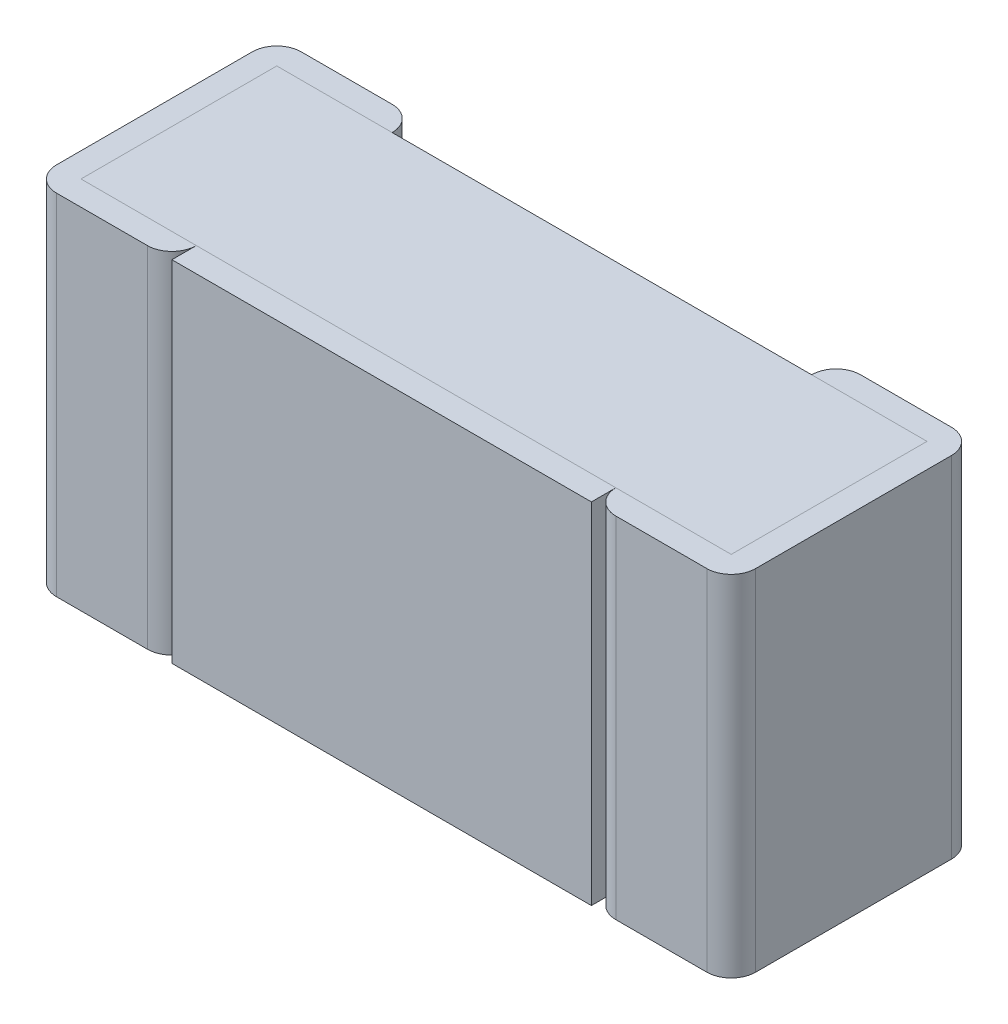
ISO-10303-21;
HEADER;
FILE_DESCRIPTION(('STEP AP214'),'2;1');
FILE_NAME('part.step','',(''),(''),'','','');
FILE_SCHEMA(('AUTOMOTIVE_DESIGN { 1 0 10303 214 1 1 1 1 }'));
ENDSEC;
DATA;
#1=APPLICATION_CONTEXT('core data for automotive mechanical design processes');
#2=APPLICATION_PROTOCOL_DEFINITION('international standard','automotive_design',2000,#1);
#3=PRODUCT_CONTEXT('',#1,'mechanical');
#4=PRODUCT('Part','Part','',(#3));
#5=PRODUCT_RELATED_PRODUCT_CATEGORY('part','',(#4));
#6=PRODUCT_DEFINITION_FORMATION('','',#4);
#7=PRODUCT_DEFINITION_CONTEXT('part definition',#1,'design');
#8=PRODUCT_DEFINITION('design','',#6,#7);
#9=PRODUCT_DEFINITION_SHAPE('','',#8);
#10=(LENGTH_UNIT() NAMED_UNIT(*) SI_UNIT(.MILLI.,.METRE.));
#11=(NAMED_UNIT(*) PLANE_ANGLE_UNIT() SI_UNIT($,.RADIAN.));
#12=(NAMED_UNIT(*) SI_UNIT($,.STERADIAN.) SOLID_ANGLE_UNIT());
#13=UNCERTAINTY_MEASURE_WITH_UNIT(LENGTH_MEASURE(1.E-05),#10,'distance_accuracy_value','');
#14=(GEOMETRIC_REPRESENTATION_CONTEXT(3) GLOBAL_UNCERTAINTY_ASSIGNED_CONTEXT((#13)) GLOBAL_UNIT_ASSIGNED_CONTEXT((#10,
#11,#12)) REPRESENTATION_CONTEXT('',''));
#15=CARTESIAN_POINT('',(0.,0.,0.));
#16=DIRECTION('',(0.,0.,1.));
#17=DIRECTION('',(1.,0.,0.));
#18=AXIS2_PLACEMENT_3D('',#15,#16,#17);
#19=CARTESIAN_POINT('',(-0.3,-0.25,0.35));
#20=DIRECTION('',(0.,0.,1.));
#21=DIRECTION('',(1.,0.,0.));
#22=AXIS2_PLACEMENT_3D('',#19,#20,#21);
#23=PLANE('',#22);
#24=DIRECTION('',(0.,1.,0.));
#25=VECTOR('',#24,1.);
#26=CARTESIAN_POINT('',(-0.3,-0.25,0.35));
#27=LINE('',#26,#25);
#28=CARTESIAN_POINT('',(-0.3,-0.25,0.35));
#29=VERTEX_POINT('',#28);
#30=CARTESIAN_POINT('',(-0.3,0.25,0.35));
#31=VERTEX_POINT('',#30);
#32=EDGE_CURVE('E232',#29,#31,#27,.T.);
#33=ORIENTED_EDGE('',*,*,#32,.F.);
#34=DIRECTION('',(1.,0.,0.));
#35=VECTOR('',#34,1.);
#36=CARTESIAN_POINT('',(-0.3,-0.25,0.35));
#37=LINE('',#36,#35);
#38=CARTESIAN_POINT('',(0.3,-0.25,0.35));
#39=VERTEX_POINT('',#38);
#40=EDGE_CURVE('E344',#29,#39,#37,.T.);
#41=ORIENTED_EDGE('',*,*,#40,.T.);
#42=DIRECTION('',(0.,1.,0.));
#43=VECTOR('',#42,1.);
#44=CARTESIAN_POINT('',(0.3,-0.25,0.35));
#45=LINE('',#44,#43);
#46=CARTESIAN_POINT('',(0.3,0.25,0.35));
#47=VERTEX_POINT('',#46);
#48=EDGE_CURVE('E11',#39,#47,#45,.T.);
#49=ORIENTED_EDGE('',*,*,#48,.T.);
#50=DIRECTION('',(1.,0.,0.));
#51=VECTOR('',#50,1.);
#52=CARTESIAN_POINT('',(-0.3,0.25,0.35));
#53=LINE('',#52,#51);
#54=EDGE_CURVE('E279',#31,#47,#53,.T.);
#55=ORIENTED_EDGE('',*,*,#54,.F.);
#56=EDGE_LOOP('',(#33,#41,#49,#55));
#57=FACE_BOUND('',#56,.T.);
#58=ADVANCED_FACE('F17',(#57),#23,.T.);
#59=CARTESIAN_POINT('',(0.3,-0.25,0.315));
#60=DIRECTION('',(1.,0.,0.));
#61=DIRECTION('',(0.,1.,0.));
#62=AXIS2_PLACEMENT_3D('',#59,#60,#61);
#63=PLANE('',#62);
#64=DIRECTION('',(0.,0.,1.));
#65=VECTOR('',#64,1.);
#66=CARTESIAN_POINT('',(0.3,-0.25,0.315));
#67=LINE('',#66,#65);
#68=CARTESIAN_POINT('',(0.3,-0.25,0.315));
#69=VERTEX_POINT('',#68);
#70=EDGE_CURVE('E340',#69,#39,#67,.T.);
#71=ORIENTED_EDGE('',*,*,#70,.F.);
#72=DIRECTION('',(0.,1.,0.));
#73=VECTOR('',#72,1.);
#74=CARTESIAN_POINT('',(0.3,-0.25,0.315));
#75=LINE('',#74,#73);
#76=CARTESIAN_POINT('',(0.3,0.25,0.315));
#77=VERTEX_POINT('',#76);
#78=EDGE_CURVE('E28',#69,#77,#75,.T.);
#79=ORIENTED_EDGE('',*,*,#78,.T.);
#80=DIRECTION('',(0.,0.,1.));
#81=VECTOR('',#80,1.);
#82=CARTESIAN_POINT('',(0.3,0.25,0.315));
#83=LINE('',#82,#81);
#84=EDGE_CURVE('E242',#77,#47,#83,.T.);
#85=ORIENTED_EDGE('',*,*,#84,.T.);
#86=ORIENTED_EDGE('',*,*,#48,.F.);
#87=EDGE_LOOP('',(#71,#79,#85,#86));
#88=FACE_BOUND('',#87,.T.);
#89=ADVANCED_FACE('F538',(#88),#63,.T.);
#90=CARTESIAN_POINT('',(0.335,-0.25,0.315));
#91=DIRECTION('',(0.,1.,0.));
#92=DIRECTION('',(-1.,0.,0.));
#93=AXIS2_PLACEMENT_3D('',#90,#91,#92);
#94=CYLINDRICAL_SURFACE('',#93,0.035);
#95=CARTESIAN_POINT('',(0.335,-0.25,0.315));
#96=DIRECTION('',(0.,1.,0.));
#97=DIRECTION('',(0.,0.,1.));
#98=AXIS2_PLACEMENT_3D('',#95,#96,#97);
#99=CIRCLE('',#98,0.035);
#100=CARTESIAN_POINT('',(0.335,-0.25,0.35));
#101=VERTEX_POINT('',#100);
#102=EDGE_CURVE('E375',#69,#101,#99,.T.);
#103=ORIENTED_EDGE('',*,*,#102,.T.);
#104=DIRECTION('',(0.,1.,0.));
#105=VECTOR('',#104,1.);
#106=CARTESIAN_POINT('',(0.335,-0.25,0.35));
#107=LINE('',#106,#105);
#108=CARTESIAN_POINT('',(0.335,0.25,0.35));
#109=VERTEX_POINT('',#108);
#110=EDGE_CURVE('E363',#101,#109,#107,.T.);
#111=ORIENTED_EDGE('',*,*,#110,.T.);
#112=CARTESIAN_POINT('',(0.335,0.25,0.315));
#113=DIRECTION('',(0.,1.,0.));
#114=DIRECTION('',(0.,0.,1.));
#115=AXIS2_PLACEMENT_3D('',#112,#113,#114);
#116=CIRCLE('',#115,0.035);
#117=EDGE_CURVE('E320',#77,#109,#116,.T.);
#118=ORIENTED_EDGE('',*,*,#117,.F.);
#119=ORIENTED_EDGE('',*,*,#78,.F.);
#120=EDGE_LOOP('',(#103,#111,#118,#119));
#121=FACE_BOUND('',#120,.T.);
#122=ADVANCED_FACE('F543',(#121),#94,.T.);
#123=CARTESIAN_POINT('',(0.3,-0.25,0.35));
#124=DIRECTION('',(0.,0.,1.));
#125=DIRECTION('',(1.,0.,0.));
#126=AXIS2_PLACEMENT_3D('',#123,#124,#125);
#127=PLANE('',#126);
#128=DIRECTION('',(1.,0.,0.));
#129=VECTOR('',#128,1.);
#130=CARTESIAN_POINT('',(0.3,0.25,0.35));
#131=LINE('',#130,#129);
#132=CARTESIAN_POINT('',(0.465,0.25,0.35));
#133=VERTEX_POINT('',#132);
#134=EDGE_CURVE('E315',#109,#133,#131,.T.);
#135=ORIENTED_EDGE('',*,*,#134,.F.);
#136=ORIENTED_EDGE('',*,*,#110,.F.);
#137=DIRECTION('',(1.,0.,0.));
#138=VECTOR('',#137,1.);
#139=CARTESIAN_POINT('',(0.3,-0.25,0.35));
#140=LINE('',#139,#138);
#141=CARTESIAN_POINT('',(0.465,-0.25,0.35));
#142=VERTEX_POINT('',#141);
#143=EDGE_CURVE('E308',#101,#142,#140,.T.);
#144=ORIENTED_EDGE('',*,*,#143,.T.);
#145=DIRECTION('',(0.,1.,0.));
#146=VECTOR('',#145,1.);
#147=CARTESIAN_POINT('',(0.465,-0.25,0.35));
#148=LINE('',#147,#146);
#149=EDGE_CURVE('E360',#142,#133,#148,.T.);
#150=ORIENTED_EDGE('',*,*,#149,.T.);
#151=EDGE_LOOP('',(#135,#136,#144,#150));
#152=FACE_BOUND('',#151,.T.);
#153=ADVANCED_FACE('F552',(#152),#127,.T.);
#154=CARTESIAN_POINT('',(0.465,-0.25,0.315));
#155=DIRECTION('',(0.,1.,0.));
#156=DIRECTION('',(1.,0.,0.));
#157=AXIS2_PLACEMENT_3D('',#154,#155,#156);
#158=CYLINDRICAL_SURFACE('',#157,0.035);
#159=DIRECTION('',(0.,1.,0.));
#160=VECTOR('',#159,1.);
#161=CARTESIAN_POINT('',(0.5,-0.25,0.315));
#162=LINE('',#161,#160);
#163=CARTESIAN_POINT('',(0.5,-0.25,0.315));
#164=VERTEX_POINT('',#163);
#165=CARTESIAN_POINT('',(0.5,0.25,0.315));
#166=VERTEX_POINT('',#165);
#167=EDGE_CURVE('E364',#164,#166,#162,.T.);
#168=ORIENTED_EDGE('',*,*,#167,.T.);
#169=CARTESIAN_POINT('',(0.465,0.25,0.315));
#170=DIRECTION('',(0.,-1.,0.));
#171=DIRECTION('',(0.,0.,1.));
#172=AXIS2_PLACEMENT_3D('',#169,#170,#171);
#173=CIRCLE('',#172,0.035);
#174=EDGE_CURVE('E319',#166,#133,#173,.T.);
#175=ORIENTED_EDGE('',*,*,#174,.T.);
#176=ORIENTED_EDGE('',*,*,#149,.F.);
#177=CARTESIAN_POINT('',(0.465,-0.25,0.315));
#178=DIRECTION('',(0.,-1.,0.));
#179=DIRECTION('',(0.,0.,1.));
#180=AXIS2_PLACEMENT_3D('',#177,#178,#179);
#181=CIRCLE('',#180,0.035);
#182=EDGE_CURVE('E305',#164,#142,#181,.T.);
#183=ORIENTED_EDGE('',*,*,#182,.F.);
#184=EDGE_LOOP('',(#168,#175,#176,#183));
#185=FACE_BOUND('',#184,.T.);
#186=ADVANCED_FACE('F502',(#185),#158,.T.);
#187=CARTESIAN_POINT('',(0.5,-0.25,0.));
#188=DIRECTION('',(1.,0.,0.));
#189=DIRECTION('',(0.,1.,0.));
#190=AXIS2_PLACEMENT_3D('',#187,#188,#189);
#191=PLANE('',#190);
#192=DIRECTION('',(0.,0.,1.));
#193=VECTOR('',#192,1.);
#194=CARTESIAN_POINT('',(0.5,-0.25,0.));
#195=LINE('',#194,#193);
#196=CARTESIAN_POINT('',(0.5,-0.25,0.035));
#197=VERTEX_POINT('',#196);
#198=EDGE_CURVE('E309',#197,#164,#195,.T.);
#199=ORIENTED_EDGE('',*,*,#198,.F.);
#200=DIRECTION('',(0.,1.,0.));
#201=VECTOR('',#200,1.);
#202=CARTESIAN_POINT('',(0.5,-0.25,0.035));
#203=LINE('',#202,#201);
#204=CARTESIAN_POINT('',(0.5,0.25,0.035));
#205=VERTEX_POINT('',#204);
#206=EDGE_CURVE('E403',#197,#205,#203,.T.);
#207=ORIENTED_EDGE('',*,*,#206,.T.);
#208=DIRECTION('',(0.,0.,1.));
#209=VECTOR('',#208,1.);
#210=CARTESIAN_POINT('',(0.5,0.25,0.));
#211=LINE('',#210,#209);
#212=EDGE_CURVE('E413',#205,#166,#211,.T.);
#213=ORIENTED_EDGE('',*,*,#212,.T.);
#214=ORIENTED_EDGE('',*,*,#167,.F.);
#215=EDGE_LOOP('',(#199,#207,#213,#214));
#216=FACE_BOUND('',#215,.T.);
#217=ADVANCED_FACE('F492',(#216),#191,.T.);
#218=CARTESIAN_POINT('',(0.465,-0.25,0.035));
#219=DIRECTION('',(0.,1.,0.));
#220=DIRECTION('',(1.,0.,0.));
#221=AXIS2_PLACEMENT_3D('',#218,#219,#220);
#222=CYLINDRICAL_SURFACE('',#221,0.035);
#223=CARTESIAN_POINT('',(0.465,-0.25,0.035));
#224=DIRECTION('',(0.,1.,0.));
#225=DIRECTION('',(0.,0.,1.));
#226=AXIS2_PLACEMENT_3D('',#223,#224,#225);
#227=CIRCLE('',#226,0.035);
#228=CARTESIAN_POINT('',(0.465,-0.25,0.));
#229=VERTEX_POINT('',#228);
#230=EDGE_CURVE('E370',#197,#229,#227,.T.);
#231=ORIENTED_EDGE('',*,*,#230,.T.);
#232=DIRECTION('',(0.,1.,0.));
#233=VECTOR('',#232,1.);
#234=CARTESIAN_POINT('',(0.465,-0.25,0.));
#235=LINE('',#234,#233);
#236=CARTESIAN_POINT('',(0.465,0.25,0.));
#237=VERTEX_POINT('',#236);
#238=EDGE_CURVE('E399',#229,#237,#235,.T.);
#239=ORIENTED_EDGE('',*,*,#238,.T.);
#240=CARTESIAN_POINT('',(0.465,0.25,0.035));
#241=DIRECTION('',(0.,1.,0.));
#242=DIRECTION('',(0.,0.,1.));
#243=AXIS2_PLACEMENT_3D('',#240,#241,#242);
#244=CIRCLE('',#243,0.035);
#245=EDGE_CURVE('E459',#205,#237,#244,.T.);
#246=ORIENTED_EDGE('',*,*,#245,.F.);
#247=ORIENTED_EDGE('',*,*,#206,.F.);
#248=EDGE_LOOP('',(#231,#239,#246,#247));
#249=FACE_BOUND('',#248,.T.);
#250=ADVANCED_FACE('F658',(#249),#222,.T.);
#251=CARTESIAN_POINT('',(0.3,-0.25,0.));
#252=DIRECTION('',(0.,0.,1.));
#253=DIRECTION('',(1.,0.,0.));
#254=AXIS2_PLACEMENT_3D('',#251,#252,#253);
#255=PLANE('',#254);
#256=ORIENTED_EDGE('',*,*,#238,.F.);
#257=DIRECTION('',(1.,0.,0.));
#258=VECTOR('',#257,1.);
#259=CARTESIAN_POINT('',(0.3,-0.25,0.));
#260=LINE('',#259,#258);
#261=CARTESIAN_POINT('',(0.335,-0.25,0.));
#262=VERTEX_POINT('',#261);
#263=EDGE_CURVE('E345',#262,#229,#260,.T.);
#264=ORIENTED_EDGE('',*,*,#263,.F.);
#265=DIRECTION('',(0.,1.,0.));
#266=VECTOR('',#265,1.);
#267=CARTESIAN_POINT('',(0.335,-0.25,0.));
#268=LINE('',#267,#266);
#269=CARTESIAN_POINT('',(0.335,0.25,0.));
#270=VERTEX_POINT('',#269);
#271=EDGE_CURVE('E404',#262,#270,#268,.T.);
#272=ORIENTED_EDGE('',*,*,#271,.T.);
#273=DIRECTION('',(1.,0.,0.));
#274=VECTOR('',#273,1.);
#275=CARTESIAN_POINT('',(0.3,0.25,0.));
#276=LINE('',#275,#274);
#277=EDGE_CURVE('E236',#270,#237,#276,.T.);
#278=ORIENTED_EDGE('',*,*,#277,.T.);
#279=EDGE_LOOP('',(#256,#264,#272,#278));
#280=FACE_BOUND('',#279,.T.);
#281=ADVANCED_FACE('F19',(#280),#255,.F.);
#282=CARTESIAN_POINT('',(0.335,-0.25,0.035));
#283=DIRECTION('',(0.,1.,0.));
#284=DIRECTION('',(-1.,0.,0.));
#285=AXIS2_PLACEMENT_3D('',#282,#283,#284);
#286=CYLINDRICAL_SURFACE('',#285,0.035);
#287=DIRECTION('',(0.,1.,0.));
#288=VECTOR('',#287,1.);
#289=CARTESIAN_POINT('',(0.3,-0.25,0.035));
#290=LINE('',#289,#288);
#291=CARTESIAN_POINT('',(0.3,-0.25,0.035));
#292=VERTEX_POINT('',#291);
#293=CARTESIAN_POINT('',(0.3,0.25,0.035));
#294=VERTEX_POINT('',#293);
#295=EDGE_CURVE('E371',#292,#294,#290,.T.);
#296=ORIENTED_EDGE('',*,*,#295,.T.);
#297=CARTESIAN_POINT('',(0.335,0.25,0.035));
#298=DIRECTION('',(0.,-1.,0.));
#299=DIRECTION('',(0.,0.,1.));
#300=AXIS2_PLACEMENT_3D('',#297,#298,#299);
#301=CIRCLE('',#300,0.035);
#302=EDGE_CURVE('E346',#294,#270,#301,.T.);
#303=ORIENTED_EDGE('',*,*,#302,.T.);
#304=ORIENTED_EDGE('',*,*,#271,.F.);
#305=CARTESIAN_POINT('',(0.335,-0.25,0.035));
#306=DIRECTION('',(0.,-1.,0.));
#307=DIRECTION('',(0.,0.,1.));
#308=AXIS2_PLACEMENT_3D('',#305,#306,#307);
#309=CIRCLE('',#308,0.035);
#310=EDGE_CURVE('E356',#292,#262,#309,.T.);
#311=ORIENTED_EDGE('',*,*,#310,.F.);
#312=EDGE_LOOP('',(#296,#303,#304,#311));
#313=FACE_BOUND('',#312,.T.);
#314=ADVANCED_FACE('F521',(#313),#286,.T.);
#315=CARTESIAN_POINT('',(-0.3,0.25,0.315));
#316=DIRECTION('',(0.,1.,0.));
#317=DIRECTION('',(1.,0.,0.));
#318=AXIS2_PLACEMENT_3D('',#315,#316,#317);
#319=PLANE('',#318);
#320=DIRECTION('',(1.,0.,0.));
#321=VECTOR('',#320,1.);
#322=CARTESIAN_POINT('',(-0.3,0.25,0.315));
#323=LINE('',#322,#321);
#324=CARTESIAN_POINT('',(-0.3,0.25,0.315));
#325=VERTEX_POINT('',#324);
#326=EDGE_CURVE('E240',#325,#77,#323,.T.);
#327=ORIENTED_EDGE('',*,*,#326,.F.);
#328=DIRECTION('',(0.,0.,1.));
#329=VECTOR('',#328,1.);
#330=CARTESIAN_POINT('',(-0.3,0.25,0.315));
#331=LINE('',#330,#329);
#332=EDGE_CURVE('E225',#325,#31,#331,.T.);
#333=ORIENTED_EDGE('',*,*,#332,.T.);
#334=ORIENTED_EDGE('',*,*,#54,.T.);
#335=ORIENTED_EDGE('',*,*,#84,.F.);
#336=EDGE_LOOP('',(#327,#333,#334,#335));
#337=FACE_BOUND('',#336,.T.);
#338=ADVANCED_FACE('F241',(#337),#319,.T.);
#339=CARTESIAN_POINT('',(0.3,0.25,0.));
#340=DIRECTION('',(0.,1.,0.));
#341=DIRECTION('',(1.,0.,0.));
#342=AXIS2_PLACEMENT_3D('',#339,#340,#341);
#343=PLANE('',#342);
#344=ORIENTED_EDGE('',*,*,#277,.F.);
#345=ORIENTED_EDGE('',*,*,#302,.F.);
#346=DIRECTION('',(1.,0.,0.));
#347=VECTOR('',#346,1.);
#348=CARTESIAN_POINT('',(-0.465,0.25,0.035));
#349=LINE('',#348,#347);
#350=CARTESIAN_POINT('',(0.465,0.25,0.035));
#351=VERTEX_POINT('',#350);
#352=EDGE_CURVE('E350',#294,#351,#349,.T.);
#353=ORIENTED_EDGE('',*,*,#352,.T.);
#354=DIRECTION('',(0.,0.,1.));
#355=VECTOR('',#354,1.);
#356=CARTESIAN_POINT('',(0.465,0.25,0.035));
#357=LINE('',#356,#355);
#358=CARTESIAN_POINT('',(0.465,0.25,0.315));
#359=VERTEX_POINT('',#358);
#360=EDGE_CURVE('E298',#351,#359,#357,.T.);
#361=ORIENTED_EDGE('',*,*,#360,.T.);
#362=DIRECTION('',(1.,0.,0.));
#363=VECTOR('',#362,1.);
#364=CARTESIAN_POINT('',(-0.465,0.25,0.315));
#365=LINE('',#364,#363);
#366=EDGE_CURVE('E248',#77,#359,#365,.T.);
#367=ORIENTED_EDGE('',*,*,#366,.F.);
#368=ORIENTED_EDGE('',*,*,#117,.T.);
#369=ORIENTED_EDGE('',*,*,#134,.T.);
#370=ORIENTED_EDGE('',*,*,#174,.F.);
#371=ORIENTED_EDGE('',*,*,#212,.F.);
#372=ORIENTED_EDGE('',*,*,#245,.T.);
#373=EDGE_LOOP('',(#344,#345,#353,#361,#367,#368,#369,#370,#371,#372));
#374=FACE_BOUND('',#373,.T.);
#375=ADVANCED_FACE('F498',(#374),#343,.T.);
#376=CARTESIAN_POINT('',(-0.3,-0.25,0.315));
#377=DIRECTION('',(1.,0.,0.));
#378=DIRECTION('',(0.,1.,0.));
#379=AXIS2_PLACEMENT_3D('',#376,#377,#378);
#380=PLANE('',#379);
#381=ORIENTED_EDGE('',*,*,#32,.T.);
#382=ORIENTED_EDGE('',*,*,#332,.F.);
#383=DIRECTION('',(0.,1.,0.));
#384=VECTOR('',#383,1.);
#385=CARTESIAN_POINT('',(-0.3,-0.25,0.315));
#386=LINE('',#385,#384);
#387=CARTESIAN_POINT('',(-0.3,-0.25,0.315));
#388=VERTEX_POINT('',#387);
#389=EDGE_CURVE('E230',#388,#325,#386,.T.);
#390=ORIENTED_EDGE('',*,*,#389,.F.);
#391=DIRECTION('',(0.,0.,1.));
#392=VECTOR('',#391,1.);
#393=CARTESIAN_POINT('',(-0.3,-0.25,0.315));
#394=LINE('',#393,#392);
#395=EDGE_CURVE('E381',#388,#29,#394,.T.);
#396=ORIENTED_EDGE('',*,*,#395,.T.);
#397=EDGE_LOOP('',(#381,#382,#390,#396));
#398=FACE_BOUND('',#397,.T.);
#399=ADVANCED_FACE('F227',(#398),#380,.F.);
#400=CARTESIAN_POINT('',(-0.3,-0.25,0.315));
#401=DIRECTION('',(0.,1.,0.));
#402=DIRECTION('',(1.,0.,0.));
#403=AXIS2_PLACEMENT_3D('',#400,#401,#402);
#404=PLANE('',#403);
#405=ORIENTED_EDGE('',*,*,#70,.T.);
#406=ORIENTED_EDGE('',*,*,#40,.F.);
#407=ORIENTED_EDGE('',*,*,#395,.F.);
#408=DIRECTION('',(1.,0.,0.));
#409=VECTOR('',#408,1.);
#410=CARTESIAN_POINT('',(-0.3,-0.25,0.315));
#411=LINE('',#410,#409);
#412=EDGE_CURVE('E335',#388,#69,#411,.T.);
#413=ORIENTED_EDGE('',*,*,#412,.T.);
#414=EDGE_LOOP('',(#405,#406,#407,#413));
#415=FACE_BOUND('',#414,.T.);
#416=ADVANCED_FACE('F475',(#415),#404,.F.);
#417=CARTESIAN_POINT('',(0.3,-0.25,0.));
#418=DIRECTION('',(0.,1.,0.));
#419=DIRECTION('',(1.,0.,0.));
#420=AXIS2_PLACEMENT_3D('',#417,#418,#419);
#421=PLANE('',#420);
#422=ORIENTED_EDGE('',*,*,#230,.F.);
#423=ORIENTED_EDGE('',*,*,#198,.T.);
#424=ORIENTED_EDGE('',*,*,#182,.T.);
#425=ORIENTED_EDGE('',*,*,#143,.F.);
#426=ORIENTED_EDGE('',*,*,#102,.F.);
#427=DIRECTION('',(1.,0.,0.));
#428=VECTOR('',#427,1.);
#429=CARTESIAN_POINT('',(-0.465,-0.25,0.315));
#430=LINE('',#429,#428);
#431=CARTESIAN_POINT('',(0.465,-0.25,0.315));
#432=VERTEX_POINT('',#431);
#433=EDGE_CURVE('E339',#69,#432,#430,.T.);
#434=ORIENTED_EDGE('',*,*,#433,.T.);
#435=DIRECTION('',(0.,0.,1.));
#436=VECTOR('',#435,1.);
#437=CARTESIAN_POINT('',(0.465,-0.25,0.035));
#438=LINE('',#437,#436);
#439=CARTESIAN_POINT('',(0.465,-0.25,0.035));
#440=VERTEX_POINT('',#439);
#441=EDGE_CURVE('E428',#440,#432,#438,.T.);
#442=ORIENTED_EDGE('',*,*,#441,.F.);
#443=DIRECTION('',(1.,0.,0.));
#444=VECTOR('',#443,1.);
#445=CARTESIAN_POINT('',(-0.465,-0.25,0.035));
#446=LINE('',#445,#444);
#447=EDGE_CURVE('E294',#292,#440,#446,.T.);
#448=ORIENTED_EDGE('',*,*,#447,.F.);
#449=ORIENTED_EDGE('',*,*,#310,.T.);
#450=ORIENTED_EDGE('',*,*,#263,.T.);
#451=EDGE_LOOP('',(#422,#423,#424,#425,#426,#434,#442,#448,#449,#450));
#452=FACE_BOUND('',#451,.T.);
#453=ADVANCED_FACE('F506',(#452),#421,.F.);
#454=CARTESIAN_POINT('',(-0.465,-0.25,0.035));
#455=DIRECTION('',(0.,0.,1.));
#456=DIRECTION('',(1.,0.,0.));
#457=AXIS2_PLACEMENT_3D('',#454,#455,#456);
#458=PLANE('',#457);
#459=DIRECTION('',(1.,0.,0.));
#460=VECTOR('',#459,1.);
#461=CARTESIAN_POINT('',(-0.465,0.25,0.035));
#462=LINE('',#461,#460);
#463=CARTESIAN_POINT('',(-0.3,0.25,0.035));
#464=VERTEX_POINT('',#463);
#465=EDGE_CURVE('E21',#464,#294,#462,.T.);
#466=ORIENTED_EDGE('',*,*,#465,.T.);
#467=ORIENTED_EDGE('',*,*,#295,.F.);
#468=DIRECTION('',(1.,0.,0.));
#469=VECTOR('',#468,1.);
#470=CARTESIAN_POINT('',(-0.465,-0.25,0.035));
#471=LINE('',#470,#469);
#472=CARTESIAN_POINT('',(-0.3,-0.25,0.035));
#473=VERTEX_POINT('',#472);
#474=EDGE_CURVE('E290',#473,#292,#471,.T.);
#475=ORIENTED_EDGE('',*,*,#474,.F.);
#476=DIRECTION('',(0.,1.,0.));
#477=VECTOR('',#476,1.);
#478=CARTESIAN_POINT('',(-0.3,-0.25,0.035));
#479=LINE('',#478,#477);
#480=EDGE_CURVE('E295',#473,#464,#479,.T.);
#481=ORIENTED_EDGE('',*,*,#480,.T.);
#482=EDGE_LOOP('',(#466,#467,#475,#481));
#483=FACE_BOUND('',#482,.T.);
#484=ADVANCED_FACE('F528',(#483),#458,.F.);
#485=CARTESIAN_POINT('',(-0.465,0.25,0.035));
#486=DIRECTION('',(0.,1.,0.));
#487=DIRECTION('',(1.,0.,0.));
#488=AXIS2_PLACEMENT_3D('',#485,#486,#487);
#489=PLANE('',#488);
#490=DIRECTION('',(1.,0.,0.));
#491=VECTOR('',#490,1.);
#492=CARTESIAN_POINT('',(-0.465,0.25,0.035));
#493=LINE('',#492,#491);
#494=CARTESIAN_POINT('',(-0.465,0.25,0.035));
#495=VERTEX_POINT('',#494);
#496=EDGE_CURVE('E284',#495,#464,#493,.T.);
#497=ORIENTED_EDGE('',*,*,#496,.F.);
#498=DIRECTION('',(0.,0.,1.));
#499=VECTOR('',#498,1.);
#500=CARTESIAN_POINT('',(-0.465,0.25,0.035));
#501=LINE('',#500,#499);
#502=CARTESIAN_POINT('',(-0.465,0.25,0.315));
#503=VERTEX_POINT('',#502);
#504=EDGE_CURVE('E266',#495,#503,#501,.T.);
#505=ORIENTED_EDGE('',*,*,#504,.T.);
#506=DIRECTION('',(1.,0.,0.));
#507=VECTOR('',#506,1.);
#508=CARTESIAN_POINT('',(-0.465,0.25,0.315));
#509=LINE('',#508,#507);
#510=EDGE_CURVE('E263',#503,#325,#509,.T.);
#511=ORIENTED_EDGE('',*,*,#510,.T.);
#512=ORIENTED_EDGE('',*,*,#326,.T.);
#513=ORIENTED_EDGE('',*,*,#366,.T.);
#514=ORIENTED_EDGE('',*,*,#360,.F.);
#515=ORIENTED_EDGE('',*,*,#352,.F.);
#516=ORIENTED_EDGE('',*,*,#465,.F.);
#517=EDGE_LOOP('',(#497,#505,#511,#512,#513,#514,#515,#516));
#518=FACE_BOUND('',#517,.T.);
#519=ADVANCED_FACE('F264',(#518),#489,.T.);
#520=CARTESIAN_POINT('',(-0.335,-0.25,0.315));
#521=DIRECTION('',(0.,1.,0.));
#522=DIRECTION('',(1.,0.,0.));
#523=AXIS2_PLACEMENT_3D('',#520,#521,#522);
#524=CYLINDRICAL_SURFACE('',#523,0.035);
#525=ORIENTED_EDGE('',*,*,#389,.T.);
#526=CARTESIAN_POINT('',(-0.335,0.25,0.315));
#527=DIRECTION('',(0.,-1.,0.));
#528=DIRECTION('',(0.,0.,1.));
#529=AXIS2_PLACEMENT_3D('',#526,#527,#528);
#530=CIRCLE('',#529,0.035);
#531=CARTESIAN_POINT('',(-0.335,0.25,0.35));
#532=VERTEX_POINT('',#531);
#533=EDGE_CURVE('E255',#325,#532,#530,.T.);
#534=ORIENTED_EDGE('',*,*,#533,.T.);
#535=DIRECTION('',(0.,1.,0.));
#536=VECTOR('',#535,1.);
#537=CARTESIAN_POINT('',(-0.335,-0.25,0.35));
#538=LINE('',#537,#536);
#539=CARTESIAN_POINT('',(-0.335,-0.25,0.35));
#540=VERTEX_POINT('',#539);
#541=EDGE_CURVE('E260',#540,#532,#538,.T.);
#542=ORIENTED_EDGE('',*,*,#541,.F.);
#543=CARTESIAN_POINT('',(-0.335,-0.25,0.315));
#544=DIRECTION('',(0.,-1.,0.));
#545=DIRECTION('',(0.,0.,1.));
#546=AXIS2_PLACEMENT_3D('',#543,#544,#545);
#547=CIRCLE('',#546,0.035);
#548=EDGE_CURVE('E257',#388,#540,#547,.T.);
#549=ORIENTED_EDGE('',*,*,#548,.F.);
#550=EDGE_LOOP('',(#525,#534,#542,#549));
#551=FACE_BOUND('',#550,.T.);
#552=ADVANCED_FACE('F253',(#551),#524,.T.);
#553=CARTESIAN_POINT('',(-0.5,-0.25,0.35));
#554=DIRECTION('',(0.,0.,1.));
#555=DIRECTION('',(1.,0.,0.));
#556=AXIS2_PLACEMENT_3D('',#553,#554,#555);
#557=PLANE('',#556);
#558=DIRECTION('',(1.,0.,0.));
#559=VECTOR('',#558,1.);
#560=CARTESIAN_POINT('',(-0.5,0.25,0.35));
#561=LINE('',#560,#559);
#562=CARTESIAN_POINT('',(-0.465,0.25,0.35));
#563=VERTEX_POINT('',#562);
#564=EDGE_CURVE('E160',#563,#532,#561,.T.);
#565=ORIENTED_EDGE('',*,*,#564,.F.);
#566=DIRECTION('',(0.,1.,0.));
#567=VECTOR('',#566,1.);
#568=CARTESIAN_POINT('',(-0.465,-0.25,0.35));
#569=LINE('',#568,#567);
#570=CARTESIAN_POINT('',(-0.465,-0.25,0.35));
#571=VERTEX_POINT('',#570);
#572=EDGE_CURVE('E389',#571,#563,#569,.T.);
#573=ORIENTED_EDGE('',*,*,#572,.F.);
#574=DIRECTION('',(1.,0.,0.));
#575=VECTOR('',#574,1.);
#576=CARTESIAN_POINT('',(-0.5,-0.25,0.35));
#577=LINE('',#576,#575);
#578=EDGE_CURVE('E409',#571,#540,#577,.T.);
#579=ORIENTED_EDGE('',*,*,#578,.T.);
#580=ORIENTED_EDGE('',*,*,#541,.T.);
#581=EDGE_LOOP('',(#565,#573,#579,#580));
#582=FACE_BOUND('',#581,.T.);
#583=ADVANCED_FACE('F567',(#582),#557,.T.);
#584=CARTESIAN_POINT('',(-0.465,-0.25,0.035));
#585=DIRECTION('',(0.,1.,0.));
#586=DIRECTION('',(1.,0.,0.));
#587=AXIS2_PLACEMENT_3D('',#584,#585,#586);
#588=PLANE('',#587);
#589=ORIENTED_EDGE('',*,*,#474,.T.);
#590=ORIENTED_EDGE('',*,*,#447,.T.);
#591=ORIENTED_EDGE('',*,*,#441,.T.);
#592=ORIENTED_EDGE('',*,*,#433,.F.);
#593=ORIENTED_EDGE('',*,*,#412,.F.);
#594=DIRECTION('',(1.,0.,0.));
#595=VECTOR('',#594,1.);
#596=CARTESIAN_POINT('',(-0.465,-0.25,0.315));
#597=LINE('',#596,#595);
#598=CARTESIAN_POINT('',(-0.465,-0.25,0.315));
#599=VERTEX_POINT('',#598);
#600=EDGE_CURVE('E311',#599,#388,#597,.T.);
#601=ORIENTED_EDGE('',*,*,#600,.F.);
#602=DIRECTION('',(0.,0.,1.));
#603=VECTOR('',#602,1.);
#604=CARTESIAN_POINT('',(-0.465,-0.25,0.035));
#605=LINE('',#604,#603);
#606=CARTESIAN_POINT('',(-0.465,-0.25,0.035));
#607=VERTEX_POINT('',#606);
#608=EDGE_CURVE('E314',#607,#599,#605,.T.);
#609=ORIENTED_EDGE('',*,*,#608,.F.);
#610=DIRECTION('',(1.,0.,0.));
#611=VECTOR('',#610,1.);
#612=CARTESIAN_POINT('',(-0.465,-0.25,0.035));
#613=LINE('',#612,#611);
#614=EDGE_CURVE('E325',#607,#473,#613,.T.);
#615=ORIENTED_EDGE('',*,*,#614,.T.);
#616=EDGE_LOOP('',(#589,#590,#591,#592,#593,#601,#609,#615));
#617=FACE_BOUND('',#616,.T.);
#618=ADVANCED_FACE('F472',(#617),#588,.F.);
#619=CARTESIAN_POINT('',(-0.335,-0.25,0.035));
#620=DIRECTION('',(0.,1.,0.));
#621=DIRECTION('',(1.,0.,0.));
#622=AXIS2_PLACEMENT_3D('',#619,#620,#621);
#623=CYLINDRICAL_SURFACE('',#622,0.035);
#624=CARTESIAN_POINT('',(-0.335,-0.25,0.035));
#625=DIRECTION('',(0.,1.,0.));
#626=DIRECTION('',(0.,0.,1.));
#627=AXIS2_PLACEMENT_3D('',#624,#625,#626);
#628=CIRCLE('',#627,0.035);
#629=CARTESIAN_POINT('',(-0.335,-0.25,0.));
#630=VERTEX_POINT('',#629);
#631=EDGE_CURVE('E321',#473,#630,#628,.T.);
#632=ORIENTED_EDGE('',*,*,#631,.T.);
#633=DIRECTION('',(0.,1.,0.));
#634=VECTOR('',#633,1.);
#635=CARTESIAN_POINT('',(-0.335,-0.25,0.));
#636=LINE('',#635,#634);
#637=CARTESIAN_POINT('',(-0.335,0.25,0.));
#638=VERTEX_POINT('',#637);
#639=EDGE_CURVE('E283',#630,#638,#636,.T.);
#640=ORIENTED_EDGE('',*,*,#639,.T.);
#641=CARTESIAN_POINT('',(-0.335,0.25,0.035));
#642=DIRECTION('',(0.,1.,0.));
#643=DIRECTION('',(0.,0.,1.));
#644=AXIS2_PLACEMENT_3D('',#641,#642,#643);
#645=CIRCLE('',#644,0.035);
#646=EDGE_CURVE('E281',#464,#638,#645,.T.);
#647=ORIENTED_EDGE('',*,*,#646,.F.);
#648=ORIENTED_EDGE('',*,*,#480,.F.);
#649=EDGE_LOOP('',(#632,#640,#647,#648));
#650=FACE_BOUND('',#649,.T.);
#651=ADVANCED_FACE('F531',(#650),#623,.T.);
#652=CARTESIAN_POINT('',(-0.5,-0.25,0.));
#653=DIRECTION('',(0.,0.,1.));
#654=DIRECTION('',(1.,0.,0.));
#655=AXIS2_PLACEMENT_3D('',#652,#653,#654);
#656=PLANE('',#655);
#657=ORIENTED_EDGE('',*,*,#639,.F.);
#658=DIRECTION('',(1.,0.,0.));
#659=VECTOR('',#658,1.);
#660=CARTESIAN_POINT('',(-0.5,-0.25,0.));
#661=LINE('',#660,#659);
#662=CARTESIAN_POINT('',(-0.465,-0.25,0.));
#663=VERTEX_POINT('',#662);
#664=EDGE_CURVE('E299',#663,#630,#661,.T.);
#665=ORIENTED_EDGE('',*,*,#664,.F.);
#666=DIRECTION('',(0.,1.,0.));
#667=VECTOR('',#666,1.);
#668=CARTESIAN_POINT('',(-0.465,-0.25,0.));
#669=LINE('',#668,#667);
#670=CARTESIAN_POINT('',(-0.465,0.25,0.));
#671=VERTEX_POINT('',#670);
#672=EDGE_CURVE('E139',#663,#671,#669,.T.);
#673=ORIENTED_EDGE('',*,*,#672,.T.);
#674=DIRECTION('',(1.,0.,0.));
#675=VECTOR('',#674,1.);
#676=CARTESIAN_POINT('',(-0.5,0.25,0.));
#677=LINE('',#676,#675);
#678=EDGE_CURVE('E149',#671,#638,#677,.T.);
#679=ORIENTED_EDGE('',*,*,#678,.T.);
#680=EDGE_LOOP('',(#657,#665,#673,#679));
#681=FACE_BOUND('',#680,.T.);
#682=ADVANCED_FACE('F594',(#681),#656,.F.);
#683=CARTESIAN_POINT('',(-0.5,0.25,0.));
#684=DIRECTION('',(0.,1.,0.));
#685=DIRECTION('',(1.,0.,0.));
#686=AXIS2_PLACEMENT_3D('',#683,#684,#685);
#687=PLANE('',#686);
#688=ORIENTED_EDGE('',*,*,#678,.F.);
#689=CARTESIAN_POINT('',(-0.465,0.25,0.035));
#690=DIRECTION('',(0.,-1.,0.));
#691=DIRECTION('',(0.,0.,1.));
#692=AXIS2_PLACEMENT_3D('',#689,#690,#691);
#693=CIRCLE('',#692,0.035);
#694=CARTESIAN_POINT('',(-0.5,0.25,0.035));
#695=VERTEX_POINT('',#694);
#696=EDGE_CURVE('E303',#695,#671,#693,.T.);
#697=ORIENTED_EDGE('',*,*,#696,.F.);
#698=DIRECTION('',(0.,0.,1.));
#699=VECTOR('',#698,1.);
#700=CARTESIAN_POINT('',(-0.5,0.25,0.));
#701=LINE('',#700,#699);
#702=CARTESIAN_POINT('',(-0.5,0.25,0.315));
#703=VERTEX_POINT('',#702);
#704=EDGE_CURVE('E285',#695,#703,#701,.T.);
#705=ORIENTED_EDGE('',*,*,#704,.T.);
#706=CARTESIAN_POINT('',(-0.465,0.25,0.315));
#707=DIRECTION('',(0.,1.,0.));
#708=DIRECTION('',(0.,0.,1.));
#709=AXIS2_PLACEMENT_3D('',#706,#707,#708);
#710=CIRCLE('',#709,0.035);
#711=EDGE_CURVE('E191',#703,#563,#710,.T.);
#712=ORIENTED_EDGE('',*,*,#711,.T.);
#713=ORIENTED_EDGE('',*,*,#564,.T.);
#714=ORIENTED_EDGE('',*,*,#533,.F.);
#715=ORIENTED_EDGE('',*,*,#510,.F.);
#716=ORIENTED_EDGE('',*,*,#504,.F.);
#717=ORIENTED_EDGE('',*,*,#496,.T.);
#718=ORIENTED_EDGE('',*,*,#646,.T.);
#719=EDGE_LOOP('',(#688,#697,#705,#712,#713,#714,#715,#716,#717,#718));
#720=FACE_BOUND('',#719,.T.);
#721=ADVANCED_FACE('F269',(#720),#687,.T.);
#722=CARTESIAN_POINT('',(-0.465,-0.25,0.315));
#723=DIRECTION('',(0.,1.,0.));
#724=DIRECTION('',(-1.,0.,0.));
#725=AXIS2_PLACEMENT_3D('',#722,#723,#724);
#726=CYLINDRICAL_SURFACE('',#725,0.035);
#727=CARTESIAN_POINT('',(-0.465,-0.25,0.315));
#728=DIRECTION('',(0.,1.,0.));
#729=DIRECTION('',(0.,0.,1.));
#730=AXIS2_PLACEMENT_3D('',#727,#728,#729);
#731=CIRCLE('',#730,0.035);
#732=CARTESIAN_POINT('',(-0.5,-0.25,0.315));
#733=VERTEX_POINT('',#732);
#734=EDGE_CURVE('E180',#733,#571,#731,.T.);
#735=ORIENTED_EDGE('',*,*,#734,.T.);
#736=ORIENTED_EDGE('',*,*,#572,.T.);
#737=ORIENTED_EDGE('',*,*,#711,.F.);
#738=DIRECTION('',(0.,1.,0.));
#739=VECTOR('',#738,1.);
#740=CARTESIAN_POINT('',(-0.5,-0.25,0.315));
#741=LINE('',#740,#739);
#742=EDGE_CURVE('E289',#733,#703,#741,.T.);
#743=ORIENTED_EDGE('',*,*,#742,.F.);
#744=EDGE_LOOP('',(#735,#736,#737,#743));
#745=FACE_BOUND('',#744,.T.);
#746=ADVANCED_FACE('F675',(#745),#726,.T.);
#747=CARTESIAN_POINT('',(-0.465,-0.25,0.035));
#748=DIRECTION('',(0.,1.,0.));
#749=DIRECTION('',(-1.,0.,0.));
#750=AXIS2_PLACEMENT_3D('',#747,#748,#749);
#751=CYLINDRICAL_SURFACE('',#750,0.035);
#752=DIRECTION('',(0.,1.,0.));
#753=VECTOR('',#752,1.);
#754=CARTESIAN_POINT('',(-0.5,-0.25,0.035));
#755=LINE('',#754,#753);
#756=CARTESIAN_POINT('',(-0.5,-0.25,0.035));
#757=VERTEX_POINT('',#756);
#758=EDGE_CURVE('E288',#757,#695,#755,.T.);
#759=ORIENTED_EDGE('',*,*,#758,.T.);
#760=ORIENTED_EDGE('',*,*,#696,.T.);
#761=ORIENTED_EDGE('',*,*,#672,.F.);
#762=CARTESIAN_POINT('',(-0.465,-0.25,0.035));
#763=DIRECTION('',(0.,-1.,0.));
#764=DIRECTION('',(0.,0.,1.));
#765=AXIS2_PLACEMENT_3D('',#762,#763,#764);
#766=CIRCLE('',#765,0.035);
#767=EDGE_CURVE('E304',#757,#663,#766,.T.);
#768=ORIENTED_EDGE('',*,*,#767,.F.);
#769=EDGE_LOOP('',(#759,#760,#761,#768));
#770=FACE_BOUND('',#769,.T.);
#771=ADVANCED_FACE('F698',(#770),#751,.T.);
#772=CARTESIAN_POINT('',(-0.5,-0.25,0.));
#773=DIRECTION('',(0.,1.,0.));
#774=DIRECTION('',(1.,0.,0.));
#775=AXIS2_PLACEMENT_3D('',#772,#773,#774);
#776=PLANE('',#775);
#777=ORIENTED_EDGE('',*,*,#631,.F.);
#778=ORIENTED_EDGE('',*,*,#614,.F.);
#779=ORIENTED_EDGE('',*,*,#608,.T.);
#780=ORIENTED_EDGE('',*,*,#600,.T.);
#781=ORIENTED_EDGE('',*,*,#548,.T.);
#782=ORIENTED_EDGE('',*,*,#578,.F.);
#783=ORIENTED_EDGE('',*,*,#734,.F.);
#784=DIRECTION('',(0.,0.,1.));
#785=VECTOR('',#784,1.);
#786=CARTESIAN_POINT('',(-0.5,-0.25,0.));
#787=LINE('',#786,#785);
#788=EDGE_CURVE('E326',#757,#733,#787,.T.);
#789=ORIENTED_EDGE('',*,*,#788,.F.);
#790=ORIENTED_EDGE('',*,*,#767,.T.);
#791=ORIENTED_EDGE('',*,*,#664,.T.);
#792=EDGE_LOOP('',(#777,#778,#779,#780,#781,#782,#783,#789,#790,#791));
#793=FACE_BOUND('',#792,.T.);
#794=ADVANCED_FACE('F466',(#793),#776,.F.);
#795=CARTESIAN_POINT('',(-0.5,-0.25,0.));
#796=DIRECTION('',(1.,0.,0.));
#797=DIRECTION('',(0.,1.,0.));
#798=AXIS2_PLACEMENT_3D('',#795,#796,#797);
#799=PLANE('',#798);
#800=ORIENTED_EDGE('',*,*,#742,.T.);
#801=ORIENTED_EDGE('',*,*,#704,.F.);
#802=ORIENTED_EDGE('',*,*,#758,.F.);
#803=ORIENTED_EDGE('',*,*,#788,.T.);
#804=EDGE_LOOP('',(#800,#801,#802,#803));
#805=FACE_BOUND('',#804,.T.);
#806=ADVANCED_FACE('F629',(#805),#799,.F.);
#807=CLOSED_SHELL('',(#58,#89,#122,#153,#186,#217,#250,#281,#314,#338,#375,#399,#416,#453,#484,
#519,#552,#583,#618,#651,#682,#721,#746,#771,#794,#806));
#808=MANIFOLD_SOLID_BREP('B1',#807);
#809=ADVANCED_BREP_SHAPE_REPRESENTATION('',(#18,#808),#14);
#810=SHAPE_DEFINITION_REPRESENTATION(#9,#809);
ENDSEC;
END-ISO-10303-21;
